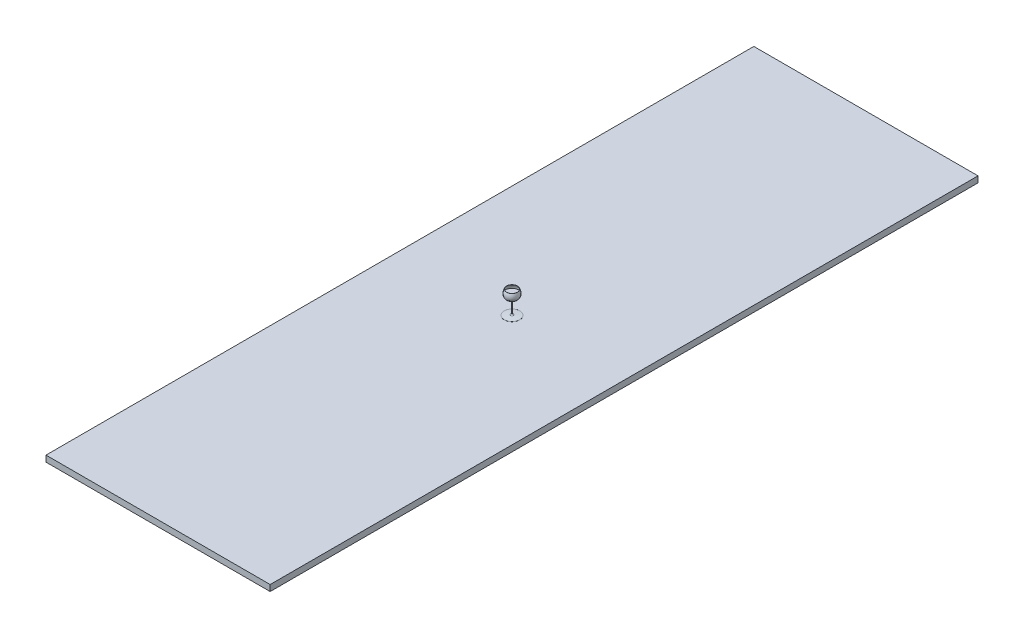
ISO-10303-21;
HEADER;
FILE_DESCRIPTION(('STEP AP214'),'2;1');
FILE_NAME('part.step','',(''),(''),'','','');
FILE_SCHEMA(('AUTOMOTIVE_DESIGN { 1 0 10303 214 1 1 1 1 }'));
ENDSEC;
DATA;
#1=APPLICATION_CONTEXT('core data for automotive mechanical design processes');
#2=APPLICATION_PROTOCOL_DEFINITION('international standard','automotive_design',2000,#1);
#3=PRODUCT_CONTEXT('',#1,'mechanical');
#4=PRODUCT('Part','Part','',(#3));
#5=PRODUCT_RELATED_PRODUCT_CATEGORY('part','',(#4));
#6=PRODUCT_DEFINITION_FORMATION('','',#4);
#7=PRODUCT_DEFINITION_CONTEXT('part definition',#1,'design');
#8=PRODUCT_DEFINITION('design','',#6,#7);
#9=PRODUCT_DEFINITION_SHAPE('','',#8);
#10=(LENGTH_UNIT() NAMED_UNIT(*) SI_UNIT(.MILLI.,.METRE.));
#11=(NAMED_UNIT(*) PLANE_ANGLE_UNIT() SI_UNIT($,.RADIAN.));
#12=(NAMED_UNIT(*) SI_UNIT($,.STERADIAN.) SOLID_ANGLE_UNIT());
#13=UNCERTAINTY_MEASURE_WITH_UNIT(LENGTH_MEASURE(1.E-05),#10,'distance_accuracy_value','');
#14=(GEOMETRIC_REPRESENTATION_CONTEXT(3) GLOBAL_UNCERTAINTY_ASSIGNED_CONTEXT((#13)) GLOBAL_UNIT_ASSIGNED_CONTEXT((#10,
#11,#12)) REPRESENTATION_CONTEXT('',''));
#15=CARTESIAN_POINT('',(0.,0.,0.));
#16=DIRECTION('',(0.,0.,1.));
#17=DIRECTION('',(1.,0.,0.));
#18=AXIS2_PLACEMENT_3D('',#15,#16,#17);
#19=CARTESIAN_POINT('',(0.,-0.358637873754159,0.));
#20=CARTESIAN_POINT('',(52.5834768728544,8.00952197359418,0.));
#21=CARTESIAN_POINT('',(62.9846093415805,43.2053697228157,0.));
#22=CARTESIAN_POINT('',(44.6112549678937,77.1230608944394,0.));
#23=B_SPLINE_CURVE_WITH_KNOTS('',3,(#19,#20,#21,#22),.UNSPECIFIED.,.F.,.F.,(4,4),(0.,1.),.UNSPECIFIED.);
#24=CARTESIAN_POINT('',(0.,82.3671650055371,0.));
#25=DIRECTION('',(0.,1.,0.));
#26=AXIS1_PLACEMENT('',#24,#25);
#27=SURFACE_OF_REVOLUTION('',#23,#26);
#28=CARTESIAN_POINT('',(0.,1.83926563060591,0.));
#29=DIRECTION('',(0.,1.,0.));
#30=DIRECTION('',(0.,0.,1.));
#31=AXIS2_PLACEMENT_3D('',#28,#29,#30);
#32=CIRCLE('',#31,10.6439075147597);
#33=CARTESIAN_POINT('',(0.,1.83926563060591,10.6439075147597));
#34=VERTEX_POINT('',#33);
#35=EDGE_CURVE('E11',#34,#34,#32,.T.);
#36=ORIENTED_EDGE('',*,*,#35,.T.);
#37=EDGE_LOOP('',(#36));
#38=FACE_BOUND('',#37,.T.);
#39=CARTESIAN_POINT('',(0.,77.1230608944394,0.));
#40=DIRECTION('',(0.,1.,0.));
#41=DIRECTION('',(0.,0.,1.));
#42=AXIS2_PLACEMENT_3D('',#39,#40,#41);
#43=CIRCLE('',#42,44.6112549678937);
#44=CARTESIAN_POINT('',(0.,77.1230608944394,44.6112549678937));
#45=VERTEX_POINT('',#44);
#46=EDGE_CURVE('E163',#45,#45,#43,.T.);
#47=ORIENTED_EDGE('',*,*,#46,.F.);
#48=EDGE_LOOP('',(#47));
#49=FACE_BOUND('',#48,.T.);
#50=ADVANCED_FACE('F37',(#38,#49),#27,.T.);
#51=CARTESIAN_POINT('',(0.,76.8849065762689,0.));
#52=DIRECTION('',(0.,1.,0.));
#53=DIRECTION('',(0.,0.,1.));
#54=AXIS2_PLACEMENT_3D('',#51,#52,#53);
#55=TOROIDAL_SURFACE('',#54,44.1716158878102,0.500000000000001);
#56=CARTESIAN_POINT('',(0.,76.6467522580983,0.));
#57=DIRECTION('',(0.,1.,0.));
#58=DIRECTION('',(0.,0.,1.));
#59=AXIS2_PLACEMENT_3D('',#56,#57,#58);
#60=CIRCLE('',#59,43.7319768077266);
#61=CARTESIAN_POINT('',(0.,76.6467522580983,43.7319768077266));
#62=VERTEX_POINT('',#61);
#63=EDGE_CURVE('E124',#62,#62,#60,.T.);
#64=ORIENTED_EDGE('',*,*,#63,.F.);
#65=EDGE_LOOP('',(#64));
#66=FACE_BOUND('',#65,.T.);
#67=ORIENTED_EDGE('',*,*,#46,.T.);
#68=EDGE_LOOP('',(#67));
#69=FACE_BOUND('',#68,.T.);
#70=ADVANCED_FACE('F139',(#66,#69),#55,.T.);
#71=CARTESIAN_POINT('',(43.7319768077266,76.6467522580983,0.));
#72=CARTESIAN_POINT('',(44.2934707356677,75.6102198288363,0.));
#73=CARTESIAN_POINT('',(45.3812566436779,73.49712616122,0.));
#74=CARTESIAN_POINT('',(47.3082623563979,69.3111928746364,0.));
#75=CARTESIAN_POINT('',(49.2935047652855,64.0785270124445,0.));
#76=CARTESIAN_POINT('',(50.9654906219954,57.8692531412018,0.));
#77=CARTESIAN_POINT('',(52.2307949903927,49.729177762306,0.));
#78=CARTESIAN_POINT('',(51.9623581314382,39.9224175661606,0.));
#79=CARTESIAN_POINT('',(48.5557608994791,29.0463110917876,0.));
#80=CARTESIAN_POINT('',(43.0172293918789,20.9506753694162,0.));
#81=CARTESIAN_POINT('',(36.8649796813606,15.1971801681395,0.));
#82=CARTESIAN_POINT('',(31.3634182707909,11.2844960007333,0.));
#83=CARTESIAN_POINT('',(24.949414945133,7.81673993023882,0.));
#84=CARTESIAN_POINT('',(18.8249209912948,5.33453280785734,0.));
#85=CARTESIAN_POINT('',(13.4462995789806,3.61543282065179,0.));
#86=CARTESIAN_POINT('',(9.17176368205587,2.46521308739438,0.));
#87=CARTESIAN_POINT('',(5.40201323334869,1.62640281255338,0.));
#88=CARTESIAN_POINT('',(2.27182383357998,1.03173470791218,0.));
#89=CARTESIAN_POINT('',(0.648980361945896,0.757224845844275,0.));
#90=CARTESIAN_POINT('',(-0.157162796760796,0.628934835120652,0.));
#91=B_SPLINE_CURVE_WITH_KNOTS('',3,(#71,#72,#73,#74,#75,#76,#77,#78,#79,#80,#81,#82,#83,#84,#85,
#86,#87,#88,#89,#90),.UNSPECIFIED.,.F.,.F.,(4,1,1,1,1,1,1,1,1,1,1,1,1,1,1,1,1,4),(0.,0.03125,
0.0625,0.125,0.1875,0.25,0.375,0.5,0.625,0.6875,0.75,0.8125,0.875,0.90625,0.9375,0.96875,
0.984375,1.),.UNSPECIFIED.);
#92=CARTESIAN_POINT('',(0.,82.3671650055371,0.));
#93=DIRECTION('',(0.,1.,0.));
#94=AXIS1_PLACEMENT('',#92,#93);
#95=SURFACE_OF_REVOLUTION('',#91,#94);
#96=CARTESIAN_POINT('',(0.,46.3618764381848,0.));
#97=DIRECTION('',(0.,1.,0.));
#98=DIRECTION('',(0.,0.,1.));
#99=AXIS2_PLACEMENT_3D('',#96,#97,#98);
#100=CIRCLE('',#99,52.0095585099107);
#101=CARTESIAN_POINT('',(0.,46.3618764381848,52.0095585099107));
#102=VERTEX_POINT('',#101);
#103=EDGE_CURVE('E117',#102,#102,#100,.T.);
#104=ORIENTED_EDGE('',*,*,#103,.F.);
#105=EDGE_LOOP('',(#104));
#106=FACE_BOUND('',#105,.T.);
#107=ORIENTED_EDGE('',*,*,#63,.T.);
#108=EDGE_LOOP('',(#107));
#109=FACE_BOUND('',#108,.T.);
#110=ADVANCED_FACE('F174',(#106,#109),#95,.T.);
#111=CARTESIAN_POINT('',(0.,118.779315993361,0.));
#112=DIRECTION('',(0.,1.,0.));
#113=DIRECTION('',(0.,0.,1.));
#114=AXIS2_PLACEMENT_3D('',#111,#112,#113);
#115=CYLINDRICAL_SURFACE('',#114,3.1491757904139);
#116=CARTESIAN_POINT('',(0.,-7.84183094297503,0.));
#117=DIRECTION('',(0.,-1.,0.));
#118=DIRECTION('',(0.,0.,-1.));
#119=AXIS2_PLACEMENT_3D('',#116,#117,#118);
#120=CIRCLE('',#119,3.1491757904139);
#121=CARTESIAN_POINT('',(0.,-7.84183094297503,-3.1491757904139));
#122=VERTEX_POINT('',#121);
#123=EDGE_CURVE('E46',#122,#122,#120,.T.);
#124=ORIENTED_EDGE('',*,*,#123,.T.);
#125=EDGE_LOOP('',(#124));
#126=FACE_BOUND('',#125,.T.);
#127=CARTESIAN_POINT('',(0.,-93.786746195008,0.));
#128=DIRECTION('',(0.,1.,0.));
#129=DIRECTION('',(0.,0.,1.));
#130=AXIS2_PLACEMENT_3D('',#127,#128,#129);
#131=CIRCLE('',#130,3.1491757904139);
#132=CARTESIAN_POINT('',(0.,-93.786746195008,3.1491757904139));
#133=VERTEX_POINT('',#132);
#134=EDGE_CURVE('E161',#133,#133,#131,.T.);
#135=ORIENTED_EDGE('',*,*,#134,.T.);
#136=EDGE_LOOP('',(#135));
#137=FACE_BOUND('',#136,.T.);
#138=ADVANCED_FACE('F171',(#126,#137),#115,.T.);
#139=CARTESIAN_POINT('',(0.,-107.91606035809,0.));
#140=DIRECTION('',(0.,-1.,0.));
#141=DIRECTION('',(0.,0.,-1.));
#142=AXIS2_PLACEMENT_3D('',#139,#140,#141);
#143=CONICAL_SURFACE('',#142,63.0141695105667,1.48884569662658);
#144=CARTESIAN_POINT('',(0.,-103.753185454956,0.));
#145=DIRECTION('',(0.,-1.,0.));
#146=DIRECTION('',(0.,0.,-1.));
#147=AXIS2_PLACEMENT_3D('',#144,#145,#146);
#148=CIRCLE('',#147,12.3305864686111);
#149=CARTESIAN_POINT('',(0.,-103.753185454956,-12.3305864686111));
#150=VERTEX_POINT('',#149);
#151=EDGE_CURVE('E158',#150,#150,#148,.T.);
#152=CARTESIAN_POINT('',(0.,-107.91606035809,0.));
#153=DIRECTION('',(0.,1.,0.));
#154=DIRECTION('',(0.,0.,1.));
#155=AXIS2_PLACEMENT_3D('',#152,#153,#154);
#156=CIRCLE('',#155,63.0141695105667);
#157=CARTESIAN_POINT('',(0.,-107.91606035809,-63.0141695105667));
#158=VERTEX_POINT('',#157);
#159=EDGE_CURVE('E121',#158,#158,#156,.T.);
#160=CARTESIAN_POINT('',(0.,-103.753185454956,-12.3305864686111));
#161=CARTESIAN_POINT('',(0.,-103.796548735197,-12.8585404586315));
#162=CARTESIAN_POINT('',(0.,-103.839912015438,-13.3864944486518));
#163=CARTESIAN_POINT('',(0.,-103.92663857592,-14.4424024286926));
#164=CARTESIAN_POINT('',(0.,-103.970001856161,-14.970356418713));
#165=CARTESIAN_POINT('',(0.,-104.056728416643,-16.0262643987537));
#166=CARTESIAN_POINT('',(0.,-104.100091696884,-16.5542183887741));
#167=CARTESIAN_POINT('',(0.,-104.186818257366,-17.6101263688148));
#168=CARTESIAN_POINT('',(0.,-104.230181537607,-18.1380803588352));
#169=CARTESIAN_POINT('',(0.,-104.316908098089,-19.1939883388759));
#170=CARTESIAN_POINT('',(0.,-104.36027137833,-19.7219423288963));
#171=CARTESIAN_POINT('',(0.,-104.446997938812,-20.777850308937));
#172=CARTESIAN_POINT('',(0.,-104.490361219053,-21.3058042989574));
#173=CARTESIAN_POINT('',(0.,-104.577087779535,-22.3617122789982));
#174=CARTESIAN_POINT('',(0.,-104.620451059776,-22.8896662690185));
#175=CARTESIAN_POINT('',(0.,-104.707177620258,-23.9455742490593));
#176=CARTESIAN_POINT('',(0.,-104.750540900498,-24.4735282390796));
#177=CARTESIAN_POINT('',(0.,-104.83726746098,-25.5294362191204));
#178=CARTESIAN_POINT('',(0.,-104.880630741221,-26.0573902091407));
#179=CARTESIAN_POINT('',(0.,-104.967357301703,-27.1132981891815));
#180=CARTESIAN_POINT('',(0.,-105.010720581944,-27.6412521792019));
#181=CARTESIAN_POINT('',(0.,-105.097447142426,-28.6971601592426));
#182=CARTESIAN_POINT('',(0.,-105.140810422667,-29.225114149263));
#183=CARTESIAN_POINT('',(0.,-105.227536983149,-30.2810221293037));
#184=CARTESIAN_POINT('',(0.,-105.27090026339,-30.8089761193241));
#185=CARTESIAN_POINT('',(0.,-105.357626823872,-31.8648840993648));
#186=CARTESIAN_POINT('',(0.,-105.400990104113,-32.3928380893852));
#187=CARTESIAN_POINT('',(0.,-105.487716664595,-33.4487460694259));
#188=CARTESIAN_POINT('',(0.,-105.531079944836,-33.9767000594463));
#189=CARTESIAN_POINT('',(0.,-105.617806505318,-35.0326080394871));
#190=CARTESIAN_POINT('',(0.,-105.661169785559,-35.5605620295074));
#191=CARTESIAN_POINT('',(0.,-105.747896346041,-36.6164700095482));
#192=CARTESIAN_POINT('',(0.,-105.791259626282,-37.1444239995686));
#193=CARTESIAN_POINT('',(0.,-105.877986186764,-38.2003319796093));
#194=CARTESIAN_POINT('',(0.,-105.921349467005,-38.7282859696297));
#195=CARTESIAN_POINT('',(0.,-106.008076027487,-39.7841939496704));
#196=CARTESIAN_POINT('',(0.,-106.051439307728,-40.3121479396908));
#197=CARTESIAN_POINT('',(0.,-106.13816586821,-41.3680559197315));
#198=CARTESIAN_POINT('',(0.,-106.181529148451,-41.8960099097519));
#199=CARTESIAN_POINT('',(0.,-106.268255708933,-42.9519178897926));
#200=CARTESIAN_POINT('',(0.,-106.311618989174,-43.479871879813));
#201=CARTESIAN_POINT('',(0.,-106.398345549656,-44.5357798598537));
#202=CARTESIAN_POINT('',(0.,-106.441708829897,-45.0637338498741));
#203=CARTESIAN_POINT('',(0.,-106.528435390379,-46.1196418299149));
#204=CARTESIAN_POINT('',(0.,-106.57179867062,-46.6475958199352));
#205=CARTESIAN_POINT('',(0.,-106.658525231102,-47.703503799976));
#206=CARTESIAN_POINT('',(0.,-106.701888511343,-48.2314577899963));
#207=CARTESIAN_POINT('',(0.,-106.788615071825,-49.2873657700371));
#208=CARTESIAN_POINT('',(0.,-106.831978352066,-49.8153197600575));
#209=CARTESIAN_POINT('',(0.,-106.918704912548,-50.8712277400982));
#210=CARTESIAN_POINT('',(0.,-106.962068192789,-51.3991817301186));
#211=CARTESIAN_POINT('',(0.,-107.04879475327,-52.4550897101593));
#212=CARTESIAN_POINT('',(0.,-107.092158033511,-52.9830437001797));
#213=CARTESIAN_POINT('',(0.,-107.178884593993,-54.0389516802204));
#214=CARTESIAN_POINT('',(0.,-107.222247874234,-54.5669056702408));
#215=CARTESIAN_POINT('',(0.,-107.308974434716,-55.6228136502815));
#216=CARTESIAN_POINT('',(0.,-107.352337714957,-56.1507676403019));
#217=CARTESIAN_POINT('',(0.,-107.439064275439,-57.2066756203427));
#218=CARTESIAN_POINT('',(0.,-107.48242755568,-57.734629610363));
#219=CARTESIAN_POINT('',(0.,-107.569154116162,-58.7905375904038));
#220=CARTESIAN_POINT('',(0.,-107.612517396403,-59.3184915804241));
#221=CARTESIAN_POINT('',(0.,-107.699243956885,-60.3743995604649));
#222=CARTESIAN_POINT('',(0.,-107.742607237126,-60.9023535504852));
#223=CARTESIAN_POINT('',(0.,-107.829333797608,-61.958261530526));
#224=CARTESIAN_POINT('',(0.,-107.872697077849,-62.4862155205464));
#225=CARTESIAN_POINT('',(0.,-107.91606035809,-63.0141695105667));
#226=B_SPLINE_CURVE_WITH_KNOTS('',3,(#160,#161,#162,#163,#164,#165,#166,#167,#168,#169,#170,
#171,#172,#173,#174,#175,#176,#177,#178,#179,#180,#181,#182,#183,#184,#185,#186,#187,#188,#189,
#190,#191,#192,#193,#194,#195,#196,#197,#198,#199,#200,#201,#202,#203,#204,#205,#206,#207,#208,
#209,#210,#211,#212,#213,#214,#215,#216,#217,#218,#219,#220,#221,#222,#223,#224,#225),
.UNSPECIFIED.,.F.,.F.,(4,2,2,2,2,2,2,2,2,2,2,2,2,2,2,2,2,2,2,2,2,2,2,2,2,2,2,2,2,2,2,2,4),(0.,
1.58919542752464,3.17839085504926,4.76758628257389,6.35678171009852,7.94597713762315,
9.53517256514778,11.1243679926724,12.713563420197,14.3027588477217,15.8919542752463,
17.4811497027709,19.0703451302956,20.6595405578202,22.2487359853448,23.8379314128695,
25.4271268403941,27.0163222679187,28.6055176954433,30.194713122968,31.7839085504926,
33.3731039780172,34.9622994055419,36.5514948330665,38.1406902605911,39.7298856881158,
41.3190811156404,42.908276543165,44.4974719706896,46.0866673982143,47.6758628257389,
49.2650582532635,50.8542536807881),.UNSPECIFIED.);
#227=EDGE_CURVE('BSEAM152',#150,#158,#226,.T.);
#228=ORIENTED_EDGE('',*,*,#151,.T.);
#229=ORIENTED_EDGE('',*,*,#159,.T.);
#230=ORIENTED_EDGE('',*,*,#227,.T.);
#231=ORIENTED_EDGE('',*,*,#227,.F.);
#232=EDGE_LOOP('',(#228,#230,#229,#231));
#233=FACE_BOUND('',#232,.T.);
#234=ADVANCED_FACE('F152',(#233),#143,.T.);
#235=CARTESIAN_POINT('',(0.,-108.51606035809,0.));
#236=DIRECTION('',(0.,1.,0.));
#237=DIRECTION('',(0.,0.,1.));
#238=AXIS2_PLACEMENT_3D('',#235,#236,#237);
#239=TOROIDAL_SURFACE('',#238,63.0141695105667,0.600000000000017);
#240=ORIENTED_EDGE('',*,*,#159,.F.);
#241=EDGE_LOOP('',(#240));
#242=FACE_BOUND('',#241,.T.);
#243=CARTESIAN_POINT('',(0.,-109.11606035809,0.));
#244=DIRECTION('',(0.,1.,0.));
#245=DIRECTION('',(0.,0.,1.));
#246=AXIS2_PLACEMENT_3D('',#243,#244,#245);
#247=CIRCLE('',#246,63.0141695105667);
#248=CARTESIAN_POINT('',(0.,-109.11606035809,63.0141695105667));
#249=VERTEX_POINT('',#248);
#250=EDGE_CURVE('E114',#249,#249,#247,.T.);
#251=ORIENTED_EDGE('',*,*,#250,.T.);
#252=EDGE_LOOP('',(#251));
#253=FACE_BOUND('',#252,.T.);
#254=ADVANCED_FACE('F144',(#242,#253),#239,.T.);
#255=CARTESIAN_POINT('',(0.,-93.786746195008,0.));
#256=DIRECTION('',(0.,1.,0.));
#257=DIRECTION('',(0.,0.,1.));
#258=AXIS2_PLACEMENT_3D('',#255,#256,#257);
#259=TOROIDAL_SURFACE('',#258,13.1491757904139,10.);
#260=ORIENTED_EDGE('',*,*,#151,.F.);
#261=EDGE_LOOP('',(#260));
#262=FACE_BOUND('',#261,.T.);
#263=ORIENTED_EDGE('',*,*,#134,.F.);
#264=EDGE_LOOP('',(#263));
#265=FACE_BOUND('',#264,.T.);
#266=ADVANCED_FACE('F142',(#262,#265),#259,.F.);
#267=CARTESIAN_POINT('',(0.,-7.84183094297503,0.));
#268=DIRECTION('',(0.,-1.,0.));
#269=DIRECTION('',(0.,0.,-1.));
#270=AXIS2_PLACEMENT_3D('',#267,#268,#269);
#271=TOROIDAL_SURFACE('',#270,13.1491757904139,10.);
#272=ORIENTED_EDGE('',*,*,#35,.F.);
#273=EDGE_LOOP('',(#272));
#274=FACE_BOUND('',#273,.T.);
#275=ORIENTED_EDGE('',*,*,#123,.F.);
#276=EDGE_LOOP('',(#275));
#277=FACE_BOUND('',#276,.T.);
#278=ADVANCED_FACE('F39',(#274,#277),#271,.F.);
#279=CARTESIAN_POINT('',(0.,46.3618764381848,0.));
#280=DIRECTION('',(0.,1.,0.));
#281=DIRECTION('',(0.,0.,1.));
#282=AXIS2_PLACEMENT_3D('',#279,#280,#281);
#283=PLANE('',#282);
#284=ORIENTED_EDGE('',*,*,#103,.T.);
#285=EDGE_LOOP('',(#284));
#286=FACE_BOUND('',#285,.T.);
#287=ADVANCED_FACE('F150',(#286),#283,.T.);
#288=CARTESIAN_POINT('',(0.,-109.11606035809,0.));
#289=DIRECTION('',(0.,1.,0.));
#290=DIRECTION('',(0.,0.,1.));
#291=AXIS2_PLACEMENT_3D('',#288,#289,#290);
#292=PLANE('',#291);
#293=DIRECTION('',(0.,0.,1.));
#294=VECTOR('',#293,1.);
#295=CARTESIAN_POINT('',(914.924960037375,-109.11606035809,-2889.18144374082));
#296=LINE('',#295,#294);
#297=CARTESIAN_POINT('',(914.924960037375,-109.11606035809,-2889.18144374082));
#298=VERTEX_POINT('',#297);
#299=CARTESIAN_POINT('',(914.924960037375,-109.11606035809,2889.18144374082));
#300=VERTEX_POINT('',#299);
#301=EDGE_CURVE('E105',#298,#300,#296,.T.);
#302=ORIENTED_EDGE('',*,*,#301,.F.);
#303=DIRECTION('',(1.,0.,0.));
#304=VECTOR('',#303,1.);
#305=CARTESIAN_POINT('',(-914.924960037375,-109.11606035809,-2889.18144374082));
#306=LINE('',#305,#304);
#307=CARTESIAN_POINT('',(-914.924960037375,-109.11606035809,-2889.18144374082));
#308=VERTEX_POINT('',#307);
#309=EDGE_CURVE('E77',#308,#298,#306,.T.);
#310=ORIENTED_EDGE('',*,*,#309,.F.);
#311=DIRECTION('',(0.,0.,-1.));
#312=VECTOR('',#311,1.);
#313=CARTESIAN_POINT('',(-914.924960037375,-109.11606035809,-2889.18144374082));
#314=LINE('',#313,#312);
#315=CARTESIAN_POINT('',(-914.924960037375,-109.11606035809,2889.18144374082));
#316=VERTEX_POINT('',#315);
#317=EDGE_CURVE('E71',#316,#308,#314,.T.);
#318=ORIENTED_EDGE('',*,*,#317,.F.);
#319=DIRECTION('',(-1.,0.,0.));
#320=VECTOR('',#319,1.);
#321=CARTESIAN_POINT('',(-914.924960037375,-109.11606035809,2889.18144374082));
#322=LINE('',#321,#320);
#323=EDGE_CURVE('E95',#300,#316,#322,.T.);
#324=ORIENTED_EDGE('',*,*,#323,.F.);
#325=EDGE_LOOP('',(#302,#310,#318,#324));
#326=FACE_BOUND('',#325,.T.);
#327=ORIENTED_EDGE('',*,*,#250,.F.);
#328=EDGE_LOOP('',(#327));
#329=FACE_BOUND('',#328,.T.);
#330=ADVANCED_FACE('F186',(#326,#329),#292,.T.);
#331=CARTESIAN_POINT('',(914.924960037375,-159.11606035809,-2889.18144374082));
#332=DIRECTION('',(-1.,0.,0.));
#333=DIRECTION('',(0.,0.,1.));
#334=AXIS2_PLACEMENT_3D('',#331,#332,#333);
#335=PLANE('',#334);
#336=ORIENTED_EDGE('',*,*,#301,.T.);
#337=DIRECTION('',(0.,1.,0.));
#338=VECTOR('',#337,1.);
#339=CARTESIAN_POINT('',(914.924960037375,-159.11606035809,2889.18144374082));
#340=LINE('',#339,#338);
#341=CARTESIAN_POINT('',(914.924960037375,-159.11606035809,2889.18144374082));
#342=VERTEX_POINT('',#341);
#343=EDGE_CURVE('E96',#342,#300,#340,.T.);
#344=ORIENTED_EDGE('',*,*,#343,.F.);
#345=DIRECTION('',(0.,0.,1.));
#346=VECTOR('',#345,1.);
#347=CARTESIAN_POINT('',(914.924960037375,-159.11606035809,-2889.18144374082));
#348=LINE('',#347,#346);
#349=CARTESIAN_POINT('',(914.924960037375,-159.11606035809,-2889.18144374082));
#350=VERTEX_POINT('',#349);
#351=EDGE_CURVE('E90',#350,#342,#348,.T.);
#352=ORIENTED_EDGE('',*,*,#351,.F.);
#353=DIRECTION('',(0.,1.,0.));
#354=VECTOR('',#353,1.);
#355=CARTESIAN_POINT('',(914.924960037375,-159.11606035809,-2889.18144374082));
#356=LINE('',#355,#354);
#357=EDGE_CURVE('E101',#350,#298,#356,.T.);
#358=ORIENTED_EDGE('',*,*,#357,.T.);
#359=EDGE_LOOP('',(#336,#344,#352,#358));
#360=FACE_BOUND('',#359,.T.);
#361=ADVANCED_FACE('F188',(#360),#335,.F.);
#362=CARTESIAN_POINT('',(-914.924960037375,-159.11606035809,2889.18144374082));
#363=DIRECTION('',(0.,0.,-1.));
#364=DIRECTION('',(-1.,0.,0.));
#365=AXIS2_PLACEMENT_3D('',#362,#363,#364);
#366=PLANE('',#365);
#367=ORIENTED_EDGE('',*,*,#323,.T.);
#368=DIRECTION('',(0.,1.,0.));
#369=VECTOR('',#368,1.);
#370=CARTESIAN_POINT('',(-914.924960037375,-159.11606035809,2889.18144374082));
#371=LINE('',#370,#369);
#372=CARTESIAN_POINT('',(-914.924960037375,-159.11606035809,2889.18144374082));
#373=VERTEX_POINT('',#372);
#374=EDGE_CURVE('E93',#373,#316,#371,.T.);
#375=ORIENTED_EDGE('',*,*,#374,.F.);
#376=DIRECTION('',(-1.,0.,0.));
#377=VECTOR('',#376,1.);
#378=CARTESIAN_POINT('',(-914.924960037375,-159.11606035809,2889.18144374082));
#379=LINE('',#378,#377);
#380=EDGE_CURVE('E85',#342,#373,#379,.T.);
#381=ORIENTED_EDGE('',*,*,#380,.F.);
#382=ORIENTED_EDGE('',*,*,#343,.T.);
#383=EDGE_LOOP('',(#367,#375,#381,#382));
#384=FACE_BOUND('',#383,.T.);
#385=ADVANCED_FACE('F94',(#384),#366,.F.);
#386=CARTESIAN_POINT('',(-914.924960037375,-159.11606035809,-2889.18144374082));
#387=DIRECTION('',(1.,0.,0.));
#388=DIRECTION('',(0.,0.,-1.));
#389=AXIS2_PLACEMENT_3D('',#386,#387,#388);
#390=PLANE('',#389);
#391=ORIENTED_EDGE('',*,*,#317,.T.);
#392=DIRECTION('',(0.,1.,0.));
#393=VECTOR('',#392,1.);
#394=CARTESIAN_POINT('',(-914.924960037375,-159.11606035809,-2889.18144374082));
#395=LINE('',#394,#393);
#396=CARTESIAN_POINT('',(-914.924960037375,-159.11606035809,-2889.18144374082));
#397=VERTEX_POINT('',#396);
#398=EDGE_CURVE('E97',#397,#308,#395,.T.);
#399=ORIENTED_EDGE('',*,*,#398,.F.);
#400=DIRECTION('',(0.,0.,-1.));
#401=VECTOR('',#400,1.);
#402=CARTESIAN_POINT('',(-914.924960037375,-159.11606035809,-2889.18144374082));
#403=LINE('',#402,#401);
#404=EDGE_CURVE('E88',#373,#397,#403,.T.);
#405=ORIENTED_EDGE('',*,*,#404,.F.);
#406=ORIENTED_EDGE('',*,*,#374,.T.);
#407=EDGE_LOOP('',(#391,#399,#405,#406));
#408=FACE_BOUND('',#407,.T.);
#409=ADVANCED_FACE('F99',(#408),#390,.F.);
#410=CARTESIAN_POINT('',(-914.924960037375,-159.11606035809,-2889.18144374082));
#411=DIRECTION('',(0.,0.,1.));
#412=DIRECTION('',(1.,0.,0.));
#413=AXIS2_PLACEMENT_3D('',#410,#411,#412);
#414=PLANE('',#413);
#415=ORIENTED_EDGE('',*,*,#309,.T.);
#416=ORIENTED_EDGE('',*,*,#357,.F.);
#417=DIRECTION('',(1.,0.,0.));
#418=VECTOR('',#417,1.);
#419=CARTESIAN_POINT('',(-914.924960037375,-159.11606035809,-2889.18144374082));
#420=LINE('',#419,#418);
#421=EDGE_CURVE('E54',#397,#350,#420,.T.);
#422=ORIENTED_EDGE('',*,*,#421,.F.);
#423=ORIENTED_EDGE('',*,*,#398,.T.);
#424=EDGE_LOOP('',(#415,#416,#422,#423));
#425=FACE_BOUND('',#424,.T.);
#426=ADVANCED_FACE('F196',(#425),#414,.F.);
#427=CARTESIAN_POINT('',(0.,-159.11606035809,0.));
#428=DIRECTION('',(0.,1.,0.));
#429=DIRECTION('',(0.,0.,1.));
#430=AXIS2_PLACEMENT_3D('',#427,#428,#429);
#431=PLANE('',#430);
#432=ORIENTED_EDGE('',*,*,#351,.T.);
#433=ORIENTED_EDGE('',*,*,#380,.T.);
#434=ORIENTED_EDGE('',*,*,#404,.T.);
#435=ORIENTED_EDGE('',*,*,#421,.T.);
#436=EDGE_LOOP('',(#432,#433,#434,#435));
#437=FACE_BOUND('',#436,.T.);
#438=ADVANCED_FACE('F86',(#437),#431,.F.);
#439=CLOSED_SHELL('',(#50,#70,#110,#138,#234,#254,#266,#278,#287,#330,#361,#385,#409,#426,#438));
#440=MANIFOLD_SOLID_BREP('B2',#439);
#441=ADVANCED_BREP_SHAPE_REPRESENTATION('',(#18,#440),#14);
#442=SHAPE_DEFINITION_REPRESENTATION(#9,#441);
ENDSEC;
END-ISO-10303-21;
